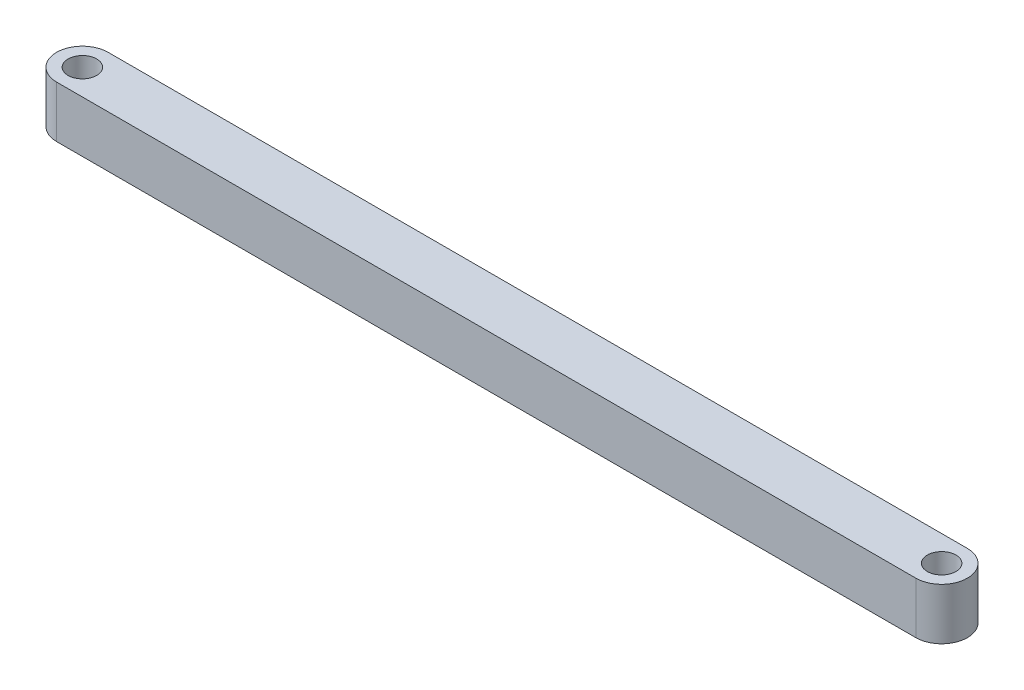
ISO-10303-21;
HEADER;
FILE_DESCRIPTION(('STEP AP214'),'2;1');
FILE_NAME('part.step','',(''),(''),'','','');
FILE_SCHEMA(('AUTOMOTIVE_DESIGN { 1 0 10303 214 1 1 1 1 }'));
ENDSEC;
DATA;
#1=APPLICATION_CONTEXT('core data for automotive mechanical design processes');
#2=APPLICATION_PROTOCOL_DEFINITION('international standard','automotive_design',2000,#1);
#3=PRODUCT_CONTEXT('',#1,'mechanical');
#4=PRODUCT('Part','Part','',(#3));
#5=PRODUCT_RELATED_PRODUCT_CATEGORY('part','',(#4));
#6=PRODUCT_DEFINITION_FORMATION('','',#4);
#7=PRODUCT_DEFINITION_CONTEXT('part definition',#1,'design');
#8=PRODUCT_DEFINITION('design','',#6,#7);
#9=PRODUCT_DEFINITION_SHAPE('','',#8);
#10=(LENGTH_UNIT() NAMED_UNIT(*) SI_UNIT(.MILLI.,.METRE.));
#11=(NAMED_UNIT(*) PLANE_ANGLE_UNIT() SI_UNIT($,.RADIAN.));
#12=(NAMED_UNIT(*) SI_UNIT($,.STERADIAN.) SOLID_ANGLE_UNIT());
#13=UNCERTAINTY_MEASURE_WITH_UNIT(LENGTH_MEASURE(1.E-05),#10,'distance_accuracy_value','');
#14=(GEOMETRIC_REPRESENTATION_CONTEXT(3) GLOBAL_UNCERTAINTY_ASSIGNED_CONTEXT((#13)) GLOBAL_UNIT_ASSIGNED_CONTEXT((#10,
#11,#12)) REPRESENTATION_CONTEXT('',''));
#15=CARTESIAN_POINT('',(0.,0.,0.));
#16=DIRECTION('',(0.,0.,1.));
#17=DIRECTION('',(1.,0.,0.));
#18=AXIS2_PLACEMENT_3D('',#15,#16,#17);
#19=CARTESIAN_POINT('',(75.,-4.5,1.61329283265843E-13));
#20=DIRECTION('',(0.,1.,0.));
#21=DIRECTION('',(0.,0.,1.));
#22=AXIS2_PLACEMENT_3D('',#19,#20,#21);
#23=CYLINDRICAL_SURFACE('',#22,4.50000000000016);
#24=CARTESIAN_POINT('',(75.,4.5,1.61329283265843E-13));
#25=DIRECTION('',(0.,1.,0.));
#26=DIRECTION('',(0.,0.,1.));
#27=AXIS2_PLACEMENT_3D('',#24,#25,#26);
#28=CIRCLE('',#27,4.50000000000016);
#29=CARTESIAN_POINT('',(75.,4.5,4.50000000000032));
#30=VERTEX_POINT('',#29);
#31=CARTESIAN_POINT('',(75.,4.5,-4.5));
#32=VERTEX_POINT('',#31);
#33=EDGE_CURVE('E104',#30,#32,#28,.T.);
#34=ORIENTED_EDGE('',*,*,#33,.F.);
#35=DIRECTION('',(0.,1.,0.));
#36=VECTOR('',#35,1.);
#37=CARTESIAN_POINT('',(75.,-4.5,4.50000000000032));
#38=LINE('',#37,#36);
#39=CARTESIAN_POINT('',(75.,-4.5,4.50000000000032));
#40=VERTEX_POINT('',#39);
#41=EDGE_CURVE('E11',#40,#30,#38,.T.);
#42=ORIENTED_EDGE('',*,*,#41,.F.);
#43=CARTESIAN_POINT('',(75.,-4.5,1.61329283265843E-13));
#44=DIRECTION('',(0.,1.,0.));
#45=DIRECTION('',(0.,0.,1.));
#46=AXIS2_PLACEMENT_3D('',#43,#44,#45);
#47=CIRCLE('',#46,4.50000000000016);
#48=CARTESIAN_POINT('',(75.,-4.5,-4.5));
#49=VERTEX_POINT('',#48);
#50=EDGE_CURVE('E97',#40,#49,#47,.T.);
#51=ORIENTED_EDGE('',*,*,#50,.T.);
#52=DIRECTION('',(0.,1.,0.));
#53=VECTOR('',#52,1.);
#54=CARTESIAN_POINT('',(75.,-4.5,-4.5));
#55=LINE('',#54,#53);
#56=EDGE_CURVE('E42',#49,#32,#55,.T.);
#57=ORIENTED_EDGE('',*,*,#56,.T.);
#58=EDGE_LOOP('',(#34,#42,#51,#57));
#59=FACE_BOUND('',#58,.T.);
#60=ADVANCED_FACE('F39',(#59),#23,.T.);
#61=CARTESIAN_POINT('',(-75.,-4.5,4.50000000000032));
#62=DIRECTION('',(0.,0.,1.));
#63=DIRECTION('',(1.,0.,0.));
#64=AXIS2_PLACEMENT_3D('',#61,#62,#63);
#65=PLANE('',#64);
#66=DIRECTION('',(1.,0.,0.));
#67=VECTOR('',#66,1.);
#68=CARTESIAN_POINT('',(-75.,4.5,4.50000000000032));
#69=LINE('',#68,#67);
#70=CARTESIAN_POINT('',(-75.,4.5,4.50000000000032));
#71=VERTEX_POINT('',#70);
#72=EDGE_CURVE('E99',#71,#30,#69,.T.);
#73=ORIENTED_EDGE('',*,*,#72,.F.);
#74=DIRECTION('',(0.,1.,0.));
#75=VECTOR('',#74,1.);
#76=CARTESIAN_POINT('',(-75.,-4.5,4.50000000000032));
#77=LINE('',#76,#75);
#78=CARTESIAN_POINT('',(-75.,-4.5,4.50000000000032));
#79=VERTEX_POINT('',#78);
#80=EDGE_CURVE('E48',#79,#71,#77,.T.);
#81=ORIENTED_EDGE('',*,*,#80,.F.);
#82=DIRECTION('',(1.,0.,0.));
#83=VECTOR('',#82,1.);
#84=CARTESIAN_POINT('',(-75.,-4.5,4.50000000000032));
#85=LINE('',#84,#83);
#86=EDGE_CURVE('E94',#79,#40,#85,.T.);
#87=ORIENTED_EDGE('',*,*,#86,.T.);
#88=ORIENTED_EDGE('',*,*,#41,.T.);
#89=EDGE_LOOP('',(#73,#81,#87,#88));
#90=FACE_BOUND('',#89,.T.);
#91=ADVANCED_FACE('F115',(#90),#65,.T.);
#92=CARTESIAN_POINT('',(-75.,-4.5,1.61329283265843E-13));
#93=DIRECTION('',(0.,1.,0.));
#94=DIRECTION('',(0.,0.,1.));
#95=AXIS2_PLACEMENT_3D('',#92,#93,#94);
#96=CYLINDRICAL_SURFACE('',#95,4.50000000000016);
#97=CARTESIAN_POINT('',(-75.,4.5,1.61329283265843E-13));
#98=DIRECTION('',(0.,1.,0.));
#99=DIRECTION('',(0.,0.,1.));
#100=AXIS2_PLACEMENT_3D('',#97,#98,#99);
#101=CIRCLE('',#100,4.50000000000016);
#102=CARTESIAN_POINT('',(-75.,4.5,-4.5));
#103=VERTEX_POINT('',#102);
#104=EDGE_CURVE('E89',#103,#71,#101,.T.);
#105=ORIENTED_EDGE('',*,*,#104,.F.);
#106=DIRECTION('',(0.,1.,0.));
#107=VECTOR('',#106,1.);
#108=CARTESIAN_POINT('',(-75.,-4.5,-4.5));
#109=LINE('',#108,#107);
#110=CARTESIAN_POINT('',(-75.,-4.5,-4.5));
#111=VERTEX_POINT('',#110);
#112=EDGE_CURVE('E84',#111,#103,#109,.T.);
#113=ORIENTED_EDGE('',*,*,#112,.F.);
#114=CARTESIAN_POINT('',(-75.,-4.5,1.61329283265843E-13));
#115=DIRECTION('',(0.,1.,0.));
#116=DIRECTION('',(0.,0.,1.));
#117=AXIS2_PLACEMENT_3D('',#114,#115,#116);
#118=CIRCLE('',#117,4.50000000000016);
#119=EDGE_CURVE('E87',#111,#79,#118,.T.);
#120=ORIENTED_EDGE('',*,*,#119,.T.);
#121=ORIENTED_EDGE('',*,*,#80,.T.);
#122=EDGE_LOOP('',(#105,#113,#120,#121));
#123=FACE_BOUND('',#122,.T.);
#124=ADVANCED_FACE('F86',(#123),#96,.T.);
#125=CARTESIAN_POINT('',(75.,-4.5,-4.5));
#126=DIRECTION('',(0.,0.,-1.));
#127=DIRECTION('',(-1.,0.,0.));
#128=AXIS2_PLACEMENT_3D('',#125,#126,#127);
#129=PLANE('',#128);
#130=DIRECTION('',(-1.,0.,0.));
#131=VECTOR('',#130,1.);
#132=CARTESIAN_POINT('',(75.,4.5,-4.5));
#133=LINE('',#132,#131);
#134=EDGE_CURVE('E107',#32,#103,#133,.T.);
#135=ORIENTED_EDGE('',*,*,#134,.F.);
#136=ORIENTED_EDGE('',*,*,#56,.F.);
#137=DIRECTION('',(-1.,0.,0.));
#138=VECTOR('',#137,1.);
#139=CARTESIAN_POINT('',(75.,-4.5,-4.5));
#140=LINE('',#139,#138);
#141=EDGE_CURVE('E93',#49,#111,#140,.T.);
#142=ORIENTED_EDGE('',*,*,#141,.T.);
#143=ORIENTED_EDGE('',*,*,#112,.T.);
#144=EDGE_LOOP('',(#135,#136,#142,#143));
#145=FACE_BOUND('',#144,.T.);
#146=ADVANCED_FACE('F96',(#145),#129,.T.);
#147=CARTESIAN_POINT('',(75.,-4.5,1.61329283265843E-13));
#148=DIRECTION('',(0.,1.,0.));
#149=DIRECTION('',(0.,0.,1.));
#150=AXIS2_PLACEMENT_3D('',#147,#148,#149);
#151=PLANE('',#150);
#152=CARTESIAN_POINT('',(-75.,-4.5,1.61329283265843E-13));
#153=DIRECTION('',(0.,1.,0.));
#154=DIRECTION('',(0.,0.,-1.));
#155=AXIS2_PLACEMENT_3D('',#152,#153,#154);
#156=CIRCLE('',#155,2.49999999999999);
#157=CARTESIAN_POINT('',(-75.,-4.5,-2.49999999999983));
#158=VERTEX_POINT('',#157);
#159=EDGE_CURVE('E148',#158,#158,#156,.T.);
#160=ORIENTED_EDGE('',*,*,#159,.T.);
#161=EDGE_LOOP('',(#160));
#162=FACE_BOUND('',#161,.T.);
#163=CARTESIAN_POINT('',(75.,-4.5,1.61329283265843E-13));
#164=DIRECTION('',(0.,1.,0.));
#165=DIRECTION('',(0.,0.,-1.));
#166=AXIS2_PLACEMENT_3D('',#163,#164,#165);
#167=CIRCLE('',#166,2.49999999999999);
#168=CARTESIAN_POINT('',(75.,-4.5,-2.49999999999983));
#169=VERTEX_POINT('',#168);
#170=EDGE_CURVE('E108',#169,#169,#167,.T.);
#171=ORIENTED_EDGE('',*,*,#170,.T.);
#172=EDGE_LOOP('',(#171));
#173=FACE_BOUND('',#172,.T.);
#174=ORIENTED_EDGE('',*,*,#50,.F.);
#175=ORIENTED_EDGE('',*,*,#86,.F.);
#176=ORIENTED_EDGE('',*,*,#119,.F.);
#177=ORIENTED_EDGE('',*,*,#141,.F.);
#178=EDGE_LOOP('',(#174,#175,#176,#177));
#179=FACE_BOUND('',#178,.T.);
#180=ADVANCED_FACE('F92',(#162,#173,#179),#151,.F.);
#181=CARTESIAN_POINT('',(75.,4.5,1.61329283265843E-13));
#182=DIRECTION('',(0.,1.,0.));
#183=DIRECTION('',(0.,0.,1.));
#184=AXIS2_PLACEMENT_3D('',#181,#182,#183);
#185=PLANE('',#184);
#186=CARTESIAN_POINT('',(-75.,4.5,1.61329283265843E-13));
#187=DIRECTION('',(0.,1.,0.));
#188=DIRECTION('',(0.,0.,-1.));
#189=AXIS2_PLACEMENT_3D('',#186,#187,#188);
#190=CIRCLE('',#189,2.49999999999999);
#191=CARTESIAN_POINT('',(-75.,4.5,-2.49999999999983));
#192=VERTEX_POINT('',#191);
#193=EDGE_CURVE('E151',#192,#192,#190,.T.);
#194=ORIENTED_EDGE('',*,*,#193,.F.);
#195=EDGE_LOOP('',(#194));
#196=FACE_BOUND('',#195,.T.);
#197=CARTESIAN_POINT('',(75.,4.5,1.61329283265843E-13));
#198=DIRECTION('',(0.,1.,0.));
#199=DIRECTION('',(0.,0.,-1.));
#200=AXIS2_PLACEMENT_3D('',#197,#198,#199);
#201=CIRCLE('',#200,2.49999999999999);
#202=CARTESIAN_POINT('',(75.,4.5,-2.49999999999983));
#203=VERTEX_POINT('',#202);
#204=EDGE_CURVE('E153',#203,#203,#201,.T.);
#205=ORIENTED_EDGE('',*,*,#204,.F.);
#206=EDGE_LOOP('',(#205));
#207=FACE_BOUND('',#206,.T.);
#208=ORIENTED_EDGE('',*,*,#33,.T.);
#209=ORIENTED_EDGE('',*,*,#134,.T.);
#210=ORIENTED_EDGE('',*,*,#104,.T.);
#211=ORIENTED_EDGE('',*,*,#72,.T.);
#212=EDGE_LOOP('',(#208,#209,#210,#211));
#213=FACE_BOUND('',#212,.T.);
#214=ADVANCED_FACE('F114',(#196,#207,#213),#185,.T.);
#215=CARTESIAN_POINT('',(75.,-4.5,1.61329283265843E-13));
#216=DIRECTION('',(0.,1.,0.));
#217=DIRECTION('',(0.,0.,1.));
#218=AXIS2_PLACEMENT_3D('',#215,#216,#217);
#219=CYLINDRICAL_SURFACE('',#218,2.49999999999999);
#220=ORIENTED_EDGE('',*,*,#170,.F.);
#221=EDGE_LOOP('',(#220));
#222=FACE_BOUND('',#221,.T.);
#223=ORIENTED_EDGE('',*,*,#204,.T.);
#224=EDGE_LOOP('',(#223));
#225=FACE_BOUND('',#224,.T.);
#226=ADVANCED_FACE('F133',(#222,#225),#219,.F.);
#227=CARTESIAN_POINT('',(-75.,-4.5,1.61329283265843E-13));
#228=DIRECTION('',(0.,1.,0.));
#229=DIRECTION('',(0.,0.,1.));
#230=AXIS2_PLACEMENT_3D('',#227,#228,#229);
#231=CYLINDRICAL_SURFACE('',#230,2.49999999999999);
#232=ORIENTED_EDGE('',*,*,#159,.F.);
#233=EDGE_LOOP('',(#232));
#234=FACE_BOUND('',#233,.T.);
#235=ORIENTED_EDGE('',*,*,#193,.T.);
#236=EDGE_LOOP('',(#235));
#237=FACE_BOUND('',#236,.T.);
#238=ADVANCED_FACE('F140',(#234,#237),#231,.F.);
#239=CLOSED_SHELL('',(#60,#91,#124,#146,#180,#214,#226,#238));
#240=MANIFOLD_SOLID_BREP('B2',#239);
#241=ADVANCED_BREP_SHAPE_REPRESENTATION('',(#18,#240),#14);
#242=SHAPE_DEFINITION_REPRESENTATION(#9,#241);
ENDSEC;
END-ISO-10303-21;
